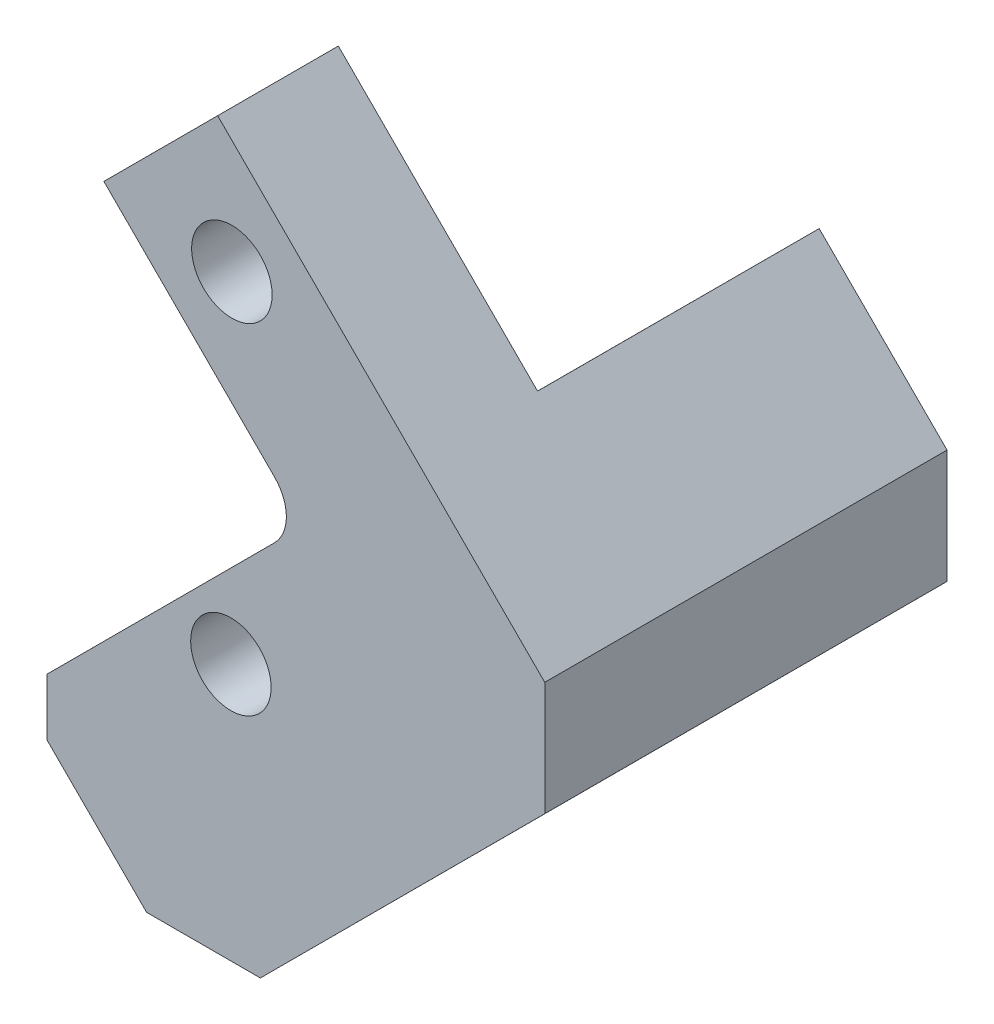
ISO-10303-21;
HEADER;
FILE_DESCRIPTION(('STEP AP214'),'2;1');
FILE_NAME('part.step','',(''),(''),'','','');
FILE_SCHEMA(('AUTOMOTIVE_DESIGN { 1 0 10303 214 1 1 1 1 }'));
ENDSEC;
DATA;
#1=APPLICATION_CONTEXT('core data for automotive mechanical design processes');
#2=APPLICATION_PROTOCOL_DEFINITION('international standard','automotive_design',2000,#1);
#3=PRODUCT_CONTEXT('',#1,'mechanical');
#4=PRODUCT('Part','Part','',(#3));
#5=PRODUCT_RELATED_PRODUCT_CATEGORY('part','',(#4));
#6=PRODUCT_DEFINITION_FORMATION('','',#4);
#7=PRODUCT_DEFINITION_CONTEXT('part definition',#1,'design');
#8=PRODUCT_DEFINITION('design','',#6,#7);
#9=PRODUCT_DEFINITION_SHAPE('','',#8);
#10=(LENGTH_UNIT() NAMED_UNIT(*) SI_UNIT(.MILLI.,.METRE.));
#11=(NAMED_UNIT(*) PLANE_ANGLE_UNIT() SI_UNIT($,.RADIAN.));
#12=(NAMED_UNIT(*) SI_UNIT($,.STERADIAN.) SOLID_ANGLE_UNIT());
#13=UNCERTAINTY_MEASURE_WITH_UNIT(LENGTH_MEASURE(1.E-05),#10,'distance_accuracy_value','');
#14=(GEOMETRIC_REPRESENTATION_CONTEXT(3) GLOBAL_UNCERTAINTY_ASSIGNED_CONTEXT((#13)) GLOBAL_UNIT_ASSIGNED_CONTEXT((#10,
#11,#12)) REPRESENTATION_CONTEXT('',''));
#15=CARTESIAN_POINT('',(0.,0.,0.));
#16=DIRECTION('',(0.,0.,1.));
#17=DIRECTION('',(1.,0.,0.));
#18=AXIS2_PLACEMENT_3D('',#15,#16,#17);
#19=CARTESIAN_POINT('',(-35.3362008856375,-178.92407937411,0.));
#20=DIRECTION('',(0.,0.,0.999999999999999));
#21=DIRECTION('',(1.,0.,0.));
#22=AXIS2_PLACEMENT_3D('',#19,#20,#21);
#23=PLANE('',#22);
#24=DIRECTION('',(0.000232541189327806,-0.999999972962297,0.));
#25=VECTOR('',#24,1.);
#26=CARTESIAN_POINT('',(-62.2811453828487,-214.8565908524,1.11022302462516E-13));
#27=LINE('',#26,#25);
#28=CARTESIAN_POINT('',(-62.2811424703116,-214.869115674172,2.22044604925031E-13));
#29=VERTEX_POINT('',#28);
#30=CARTESIAN_POINT('',(-62.2790573462297,-223.835802530266,-1.11022302462516E-13));
#31=VERTEX_POINT('',#30);
#32=EDGE_CURVE('E280',#29,#31,#27,.T.);
#33=ORIENTED_EDGE('',*,*,#32,.F.);
#34=DIRECTION('',(-0.707188992132999,-0.707024560680825,0.));
#35=VECTOR('',#34,1.);
#36=CARTESIAN_POINT('',(18.5641299909767,-134.042640883238,1.11022302462516E-13));
#37=LINE('',#36,#35);
#38=CARTESIAN_POINT('',(-3.88912050924617,-156.490670684854,1.11022302462516E-13));
#39=VERTEX_POINT('',#38);
#40=EDGE_CURVE('E309',#39,#29,#37,.T.);
#41=ORIENTED_EDGE('',*,*,#40,.F.);
#42=DIRECTION('',(-0.707024560680825,0.707188992132999,0.));
#43=VECTOR('',#42,1.);
#44=CARTESIAN_POINT('',(-35.3362008856584,-125.036276716552,0.));
#45=LINE('',#44,#43);
#46=CARTESIAN_POINT('',(16.2942692968056,-176.678754506192,1.66533453693773E-13));
#47=VERTEX_POINT('',#46);
#48=EDGE_CURVE('E292',#47,#39,#45,.T.);
#49=ORIENTED_EDGE('',*,*,#48,.F.);
#50=DIRECTION('',(-3.7997383017796E-13,1.,0.));
#51=VECTOR('',#50,1.);
#52=CARTESIAN_POINT('',(16.2942692968124,-194.641354906377,0.));
#53=LINE('',#52,#51);
#54=CARTESIAN_POINT('',(16.2942692968124,-194.641354906377,0.));
#55=VERTEX_POINT('',#54);
#56=EDGE_CURVE('E289',#55,#47,#53,.T.);
#57=ORIENTED_EDGE('',*,*,#56,.F.);
#58=DIRECTION('',(0.707024560680283,0.707188992133541,0.));
#59=VECTOR('',#58,1.);
#60=CARTESIAN_POINT('',(-28.5955276530323,-239.54159179701,1.11022302462516E-13));
#61=LINE('',#60,#59);
#62=CARTESIAN_POINT('',(-28.5955276530323,-239.54159179701,1.11022302462516E-13));
#63=VERTEX_POINT('',#62);
#64=EDGE_CURVE('E287',#63,#55,#61,.T.);
#65=ORIENTED_EDGE('',*,*,#64,.F.);
#66=DIRECTION('',(0.999999972962298,0.000232541189324975,0.));
#67=VECTOR('',#66,1.);
#68=CARTESIAN_POINT('',(-46.55812756755,-239.54576884147,1.11022302462516E-13));
#69=LINE('',#68,#67);
#70=CARTESIAN_POINT('',(-46.55812756755,-239.54576884147,1.11022302462516E-13));
#71=VERTEX_POINT('',#70);
#72=EDGE_CURVE('E284',#71,#63,#69,.T.);
#73=ORIENTED_EDGE('',*,*,#72,.F.);
#74=DIRECTION('',(0.707353385344728,-0.706860090994925,0.));
#75=VECTOR('',#74,1.);
#76=CARTESIAN_POINT('',(-62.2790573462297,-223.835802530266,-1.11022302462516E-13));
#77=LINE('',#76,#75);
#78=EDGE_CURVE('E282',#31,#71,#77,.T.);
#79=ORIENTED_EDGE('',*,*,#78,.F.);
#80=EDGE_LOOP('',(#33,#41,#49,#57,#65,#73,#79));
#81=FACE_BOUND('',#80,.T.);
#82=CARTESIAN_POINT('',(-33.247860059602,-198.975506767725,0.));
#83=DIRECTION('',(0.,0.,0.999999999999999));
#84=DIRECTION('',(1.,0.,0.));
#85=AXIS2_PLACEMENT_3D('',#82,#83,#84);
#86=CIRCLE('',#85,6.35000000000007);
#87=CARTESIAN_POINT('',(-39.5978600596023,-198.975506767725,0.));
#88=VERTEX_POINT('',#87);
#89=EDGE_CURVE('E274',#88,#88,#86,.T.);
#90=ORIENTED_EDGE('',*,*,#89,.T.);
#91=EDGE_LOOP('',(#90));
#92=FACE_BOUND('',#91,.T.);
#93=ADVANCED_FACE('F44',(#81,#92),#23,.F.);
#94=CARTESIAN_POINT('',(-35.3362008856375,-178.92407937411,63.5));
#95=DIRECTION('',(0.,0.,0.999999999999999));
#96=DIRECTION('',(1.,0.,0.));
#97=AXIS2_PLACEMENT_3D('',#94,#95,#96);
#98=PLANE('',#97);
#99=DIRECTION('',(-0.707024560680824,0.707188992133,0.));
#100=VECTOR('',#99,1.);
#101=CARTESIAN_POINT('',(-53.294625212492,-142.998877602412,63.5000000000001));
#102=LINE('',#101,#100);
#103=CARTESIAN_POINT('',(-26.3559447038848,-169.943823192322,63.5));
#104=VERTEX_POINT('',#103);
#105=CARTESIAN_POINT('',(-53.294625212492,-142.998877602412,63.5000000000001));
#106=VERTEX_POINT('',#105);
#107=EDGE_CURVE('E137',#104,#106,#102,.T.);
#108=ORIENTED_EDGE('',*,*,#107,.F.);
#109=CARTESIAN_POINT('',(-30.8465948039292,-174.433429152645,63.5));
#110=DIRECTION('',(0.,0.,0.999999999999999));
#111=DIRECTION('',(1.,0.,0.));
#112=AXIS2_PLACEMENT_3D('',#109,#110,#111);
#113=CIRCLE('',#112,6.35);
#114=CARTESIAN_POINT('',(-26.3559447038812,-178.923035112965,63.5));
#115=VERTEX_POINT('',#114);
#116=EDGE_CURVE('E52',#104,#115,#113,.F.);
#117=ORIENTED_EDGE('',*,*,#116,.T.);
#118=DIRECTION('',(-0.707024560680281,-0.707188992133543,0.));
#119=VECTOR('',#118,1.);
#120=CARTESIAN_POINT('',(-30.8455507855898,-183.41368533443,63.5000000000001));
#121=LINE('',#120,#119);
#122=CARTESIAN_POINT('',(-62.2811453828489,-214.8565908524,63.5000000000001));
#123=VERTEX_POINT('',#122);
#124=EDGE_CURVE('E260',#115,#123,#121,.T.);
#125=ORIENTED_EDGE('',*,*,#124,.T.);
#126=DIRECTION('',(0.000232541189327806,-0.999999972962297,0.));
#127=VECTOR('',#126,1.);
#128=CARTESIAN_POINT('',(-62.2811453828489,-214.8565908524,63.5000000000001));
#129=LINE('',#128,#127);
#130=CARTESIAN_POINT('',(-62.2790573462295,-223.835802530266,63.5));
#131=VERTEX_POINT('',#130);
#132=EDGE_CURVE('E259',#123,#131,#129,.T.);
#133=ORIENTED_EDGE('',*,*,#132,.T.);
#134=DIRECTION('',(0.707353385344728,-0.706860090994925,0.));
#135=VECTOR('',#134,1.);
#136=CARTESIAN_POINT('',(-62.2790573462295,-223.835802530266,63.5));
#137=LINE('',#136,#135);
#138=CARTESIAN_POINT('',(-46.5581275675504,-239.54576884147,63.5));
#139=VERTEX_POINT('',#138);
#140=EDGE_CURVE('E297',#131,#139,#137,.T.);
#141=ORIENTED_EDGE('',*,*,#140,.T.);
#142=DIRECTION('',(0.999999972962298,0.000232541189324975,0.));
#143=VECTOR('',#142,1.);
#144=CARTESIAN_POINT('',(-46.5581275675504,-239.54576884147,63.5));
#145=LINE('',#144,#143);
#146=CARTESIAN_POINT('',(-28.5955276530325,-239.54159179701,63.5));
#147=VERTEX_POINT('',#146);
#148=EDGE_CURVE('E299',#139,#147,#145,.T.);
#149=ORIENTED_EDGE('',*,*,#148,.T.);
#150=DIRECTION('',(0.707024560680283,0.707188992133541,0.));
#151=VECTOR('',#150,1.);
#152=CARTESIAN_POINT('',(-28.5955276530325,-239.54159179701,63.5));
#153=LINE('',#152,#151);
#154=CARTESIAN_POINT('',(16.2942692968122,-194.641354906377,63.5000000000001));
#155=VERTEX_POINT('',#154);
#156=EDGE_CURVE('E301',#147,#155,#153,.T.);
#157=ORIENTED_EDGE('',*,*,#156,.T.);
#158=DIRECTION('',(-3.7997383017796E-13,1.,0.));
#159=VECTOR('',#158,1.);
#160=CARTESIAN_POINT('',(16.2942692968122,-194.641354906377,63.5000000000001));
#161=LINE('',#160,#159);
#162=CARTESIAN_POINT('',(16.2942692968058,-176.678754506192,63.4999999999999));
#163=VERTEX_POINT('',#162);
#164=EDGE_CURVE('E164',#155,#163,#161,.T.);
#165=ORIENTED_EDGE('',*,*,#164,.T.);
#166=DIRECTION('',(-0.707024560680825,0.707188992132999,0.));
#167=VECTOR('',#166,1.);
#168=CARTESIAN_POINT('',(16.2942692968058,-176.678754506192,63.4999999999999));
#169=LINE('',#168,#167);
#170=CARTESIAN_POINT('',(-35.3362008856584,-125.036276716552,63.5000000000001));
#171=VERTEX_POINT('',#170);
#172=EDGE_CURVE('E158',#163,#171,#169,.T.);
#173=ORIENTED_EDGE('',*,*,#172,.T.);
#174=DIRECTION('',(-0.707024560680282,-0.707188992133542,0.));
#175=VECTOR('',#174,1.);
#176=CARTESIAN_POINT('',(-35.3362008856584,-125.036276716552,63.5000000000001));
#177=LINE('',#176,#175);
#178=EDGE_CURVE('E151',#171,#106,#177,.T.);
#179=ORIENTED_EDGE('',*,*,#178,.T.);
#180=EDGE_LOOP('',(#108,#117,#125,#133,#141,#149,#157,#165,#173,#179));
#181=FACE_BOUND('',#180,.T.);
#182=CARTESIAN_POINT('',(-33.0913978447953,-145.244202713136,63.5));
#183=DIRECTION('',(0.,0.,0.999999999999999));
#184=DIRECTION('',(1.,0.,0.));
#185=AXIS2_PLACEMENT_3D('',#182,#183,#184);
#186=CIRCLE('',#185,6.34999999999999);
#187=CARTESIAN_POINT('',(-26.7413978447953,-145.244202713136,63.5));
#188=VERTEX_POINT('',#187);
#189=EDGE_CURVE('E268',#188,#188,#186,.T.);
#190=ORIENTED_EDGE('',*,*,#189,.F.);
#191=EDGE_LOOP('',(#190));
#192=FACE_BOUND('',#191,.T.);
#193=CARTESIAN_POINT('',(-33.2478600596022,-198.975506767725,63.5000000000001));
#194=DIRECTION('',(0.,0.,0.999999999999999));
#195=DIRECTION('',(1.,0.,0.));
#196=AXIS2_PLACEMENT_3D('',#193,#194,#195);
#197=CIRCLE('',#196,6.35000000000007);
#198=CARTESIAN_POINT('',(-39.5978600596023,-198.975506767725,63.5000000000001));
#199=VERTEX_POINT('',#198);
#200=EDGE_CURVE('E277',#199,#199,#197,.T.);
#201=ORIENTED_EDGE('',*,*,#200,.F.);
#202=EDGE_LOOP('',(#201));
#203=FACE_BOUND('',#202,.T.);
#204=ADVANCED_FACE('F155',(#181,#192,#203),#98,.T.);
#205=CARTESIAN_POINT('',(-30.8455507855898,-183.41368533443,63.5000000000001));
#206=DIRECTION('',(0.707188992133543,-0.707024560680281,0.));
#207=DIRECTION('',(0.707024560680281,0.707188992133543,0.));
#208=AXIS2_PLACEMENT_3D('',#205,#206,#207);
#209=PLANE('',#208);
#210=ORIENTED_EDGE('',*,*,#124,.F.);
#211=DIRECTION('',(0.,0.,0.999999999999999));
#212=VECTOR('',#211,1.);
#213=CARTESIAN_POINT('',(-26.355944703881,-178.923035112965,44.45));
#214=LINE('',#213,#212);
#215=CARTESIAN_POINT('',(-26.355944703881,-178.923035112965,44.45));
#216=VERTEX_POINT('',#215);
#217=EDGE_CURVE('E59',#115,#216,#214,.F.);
#218=ORIENTED_EDGE('',*,*,#217,.T.);
#219=DIRECTION('',(-0.707024560680281,-0.707188992133543,0.));
#220=VECTOR('',#219,1.);
#221=CARTESIAN_POINT('',(-30.8455507855894,-183.41368533443,44.45));
#222=LINE('',#221,#220);
#223=CARTESIAN_POINT('',(-62.2811453828489,-214.8565908524,44.4500000000001));
#224=VERTEX_POINT('',#223);
#225=EDGE_CURVE('E261',#216,#224,#222,.T.);
#226=ORIENTED_EDGE('',*,*,#225,.T.);
#227=DIRECTION('',(0.,0.,-0.999999999999999));
#228=VECTOR('',#227,1.);
#229=CARTESIAN_POINT('',(-62.2811453828489,-214.8565908524,63.5000000000001));
#230=LINE('',#229,#228);
#231=EDGE_CURVE('E183',#123,#224,#230,.T.);
#232=ORIENTED_EDGE('',*,*,#231,.F.);
#233=EDGE_LOOP('',(#210,#218,#226,#232));
#234=FACE_BOUND('',#233,.T.);
#235=ADVANCED_FACE('F46',(#234),#209,.F.);
#236=CARTESIAN_POINT('',(-62.2811453828489,-214.8565908524,63.5000000000001));
#237=DIRECTION('',(0.999999972962298,0.000232541189327806,0.));
#238=DIRECTION('',(-0.000232541189327862,0.999999972962297,0.));
#239=AXIS2_PLACEMENT_3D('',#236,#237,#238);
#240=PLANE('',#239);
#241=ORIENTED_EDGE('',*,*,#231,.T.);
#242=DIRECTION('',(0.000232541189327862,-0.999999972962297,0.));
#243=VECTOR('',#242,1.);
#244=CARTESIAN_POINT('',(-62.2811453828489,-214.8565908524,44.4500000000001));
#245=LINE('',#244,#243);
#246=CARTESIAN_POINT('',(-62.281142470312,-214.869115674172,44.4500000000001));
#247=VERTEX_POINT('',#246);
#248=EDGE_CURVE('E257',#224,#247,#245,.T.);
#249=ORIENTED_EDGE('',*,*,#248,.T.);
#250=DIRECTION('',(0.,0.,-0.999999999999999));
#251=VECTOR('',#250,1.);
#252=CARTESIAN_POINT('',(-62.2811424703118,-214.869115674172,63.5000000000001));
#253=LINE('',#252,#251);
#254=EDGE_CURVE('E266',#247,#29,#253,.T.);
#255=ORIENTED_EDGE('',*,*,#254,.T.);
#256=ORIENTED_EDGE('',*,*,#32,.T.);
#257=DIRECTION('',(0.,0.,-0.999999999999999));
#258=VECTOR('',#257,1.);
#259=CARTESIAN_POINT('',(-62.2790573462295,-223.835802530266,63.5));
#260=LINE('',#259,#258);
#261=EDGE_CURVE('E180',#131,#31,#260,.T.);
#262=ORIENTED_EDGE('',*,*,#261,.F.);
#263=ORIENTED_EDGE('',*,*,#132,.F.);
#264=EDGE_LOOP('',(#241,#249,#255,#256,#262,#263));
#265=FACE_BOUND('',#264,.T.);
#266=ADVANCED_FACE('F245',(#265),#240,.F.);
#267=CARTESIAN_POINT('',(-62.2790573462295,-223.835802530266,63.5));
#268=DIRECTION('',(0.706860090994925,0.707353385344728,0.));
#269=DIRECTION('',(-0.707353385344728,0.706860090994925,0.));
#270=AXIS2_PLACEMENT_3D('',#267,#268,#269);
#271=PLANE('',#270);
#272=ORIENTED_EDGE('',*,*,#78,.T.);
#273=DIRECTION('',(0.,0.,-0.999999999999999));
#274=VECTOR('',#273,1.);
#275=CARTESIAN_POINT('',(-46.5581275675504,-239.54576884147,63.5));
#276=LINE('',#275,#274);
#277=EDGE_CURVE('E177',#139,#71,#276,.T.);
#278=ORIENTED_EDGE('',*,*,#277,.F.);
#279=ORIENTED_EDGE('',*,*,#140,.F.);
#280=ORIENTED_EDGE('',*,*,#261,.T.);
#281=EDGE_LOOP('',(#272,#278,#279,#280));
#282=FACE_BOUND('',#281,.T.);
#283=ADVANCED_FACE('F242',(#282),#271,.F.);
#284=CARTESIAN_POINT('',(-46.5581275675504,-239.54576884147,63.5));
#285=DIRECTION('',(-0.00023254118932492,0.999999972962297,0.));
#286=DIRECTION('',(-0.999999972962298,-0.000232541189324975,0.));
#287=AXIS2_PLACEMENT_3D('',#284,#285,#286);
#288=PLANE('',#287);
#289=DIRECTION('',(0.,0.,-0.999999999999999));
#290=VECTOR('',#289,1.);
#291=CARTESIAN_POINT('',(-28.5955276530325,-239.54159179701,63.5));
#292=LINE('',#291,#290);
#293=CARTESIAN_POINT('',(-28.5955276530325,-239.54159179701,25.20635639297));
#294=VERTEX_POINT('',#293);
#295=EDGE_CURVE('E173',#294,#63,#292,.T.);
#296=ORIENTED_EDGE('',*,*,#295,.F.);
#297=CARTESIAN_POINT('',(-19.6204918056211,-239.539504731443,25.4000000000001));
#298=DIRECTION('',(-0.00023254118932492,0.999999972962297,0.));
#299=DIRECTION('',(0.999999972962298,0.000232541189324975,0.));
#300=AXIS2_PLACEMENT_3D('',#297,#298,#299);
#301=ELLIPSE('',#300,8.97921216342026,6.34999999999998);
#302=CARTESIAN_POINT('',(-28.5955276530325,-239.54159179701,25.5936436070301));
#303=VERTEX_POINT('',#302);
#304=EDGE_CURVE('E311',#294,#303,#301,.T.);
#305=ORIENTED_EDGE('',*,*,#304,.T.);
#306=EDGE_CURVE('E174',#147,#303,#292,.T.);
#307=ORIENTED_EDGE('',*,*,#306,.F.);
#308=ORIENTED_EDGE('',*,*,#148,.F.);
#309=ORIENTED_EDGE('',*,*,#277,.T.);
#310=ORIENTED_EDGE('',*,*,#72,.T.);
#311=EDGE_LOOP('',(#296,#305,#307,#308,#309,#310));
#312=FACE_BOUND('',#311,.T.);
#313=ADVANCED_FACE('F238',(#312),#288,.F.);
#314=CARTESIAN_POINT('',(-28.5955276530325,-239.54159179701,63.5));
#315=DIRECTION('',(-0.707188992133541,0.707024560680283,0.));
#316=DIRECTION('',(-0.707024560680283,-0.707188992133541,0.));
#317=AXIS2_PLACEMENT_3D('',#314,#315,#316);
#318=PLANE('',#317);
#319=ORIENTED_EDGE('',*,*,#306,.T.);
#320=CARTESIAN_POINT('',(-24.1080097293285,-235.053030219189,25.3999999999999));
#321=DIRECTION('',(-0.707188992133541,0.707024560680283,0.));
#322=DIRECTION('',(-0.707024560680283,-0.707188992133541,0.));
#323=AXIS2_PLACEMENT_3D('',#320,#321,#322);
#324=CIRCLE('',#323,6.34999999999998);
#325=EDGE_CURVE('E193',#303,#294,#324,.T.);
#326=ORIENTED_EDGE('',*,*,#325,.T.);
#327=ORIENTED_EDGE('',*,*,#295,.T.);
#328=ORIENTED_EDGE('',*,*,#64,.T.);
#329=DIRECTION('',(0.,0.,-0.999999999999999));
#330=VECTOR('',#329,1.);
#331=CARTESIAN_POINT('',(16.2942692968122,-194.641354906377,63.5000000000001));
#332=LINE('',#331,#330);
#333=EDGE_CURVE('E170',#155,#55,#332,.T.);
#334=ORIENTED_EDGE('',*,*,#333,.F.);
#335=ORIENTED_EDGE('',*,*,#156,.F.);
#336=EDGE_LOOP('',(#319,#326,#327,#328,#334,#335));
#337=FACE_BOUND('',#336,.T.);
#338=ADVANCED_FACE('F234',(#337),#318,.F.);
#339=CARTESIAN_POINT('',(16.2942692968122,-194.641354906377,63.5000000000001));
#340=DIRECTION('',(-1.,-3.80140363631654E-13,0.));
#341=DIRECTION('',(3.7997383017796E-13,-1.,0.));
#342=AXIS2_PLACEMENT_3D('',#339,#340,#341);
#343=PLANE('',#342);
#344=ORIENTED_EDGE('',*,*,#56,.T.);
#345=DIRECTION('',(0.,0.,-0.999999999999999));
#346=VECTOR('',#345,1.);
#347=CARTESIAN_POINT('',(16.2942692968058,-176.678754506192,63.4999999999999));
#348=LINE('',#347,#346);
#349=EDGE_CURVE('E162',#163,#47,#348,.T.);
#350=ORIENTED_EDGE('',*,*,#349,.F.);
#351=ORIENTED_EDGE('',*,*,#164,.F.);
#352=ORIENTED_EDGE('',*,*,#333,.T.);
#353=EDGE_LOOP('',(#344,#350,#351,#352));
#354=FACE_BOUND('',#353,.T.);
#355=ADVANCED_FACE('F230',(#354),#343,.F.);
#356=CARTESIAN_POINT('',(-35.3362008856584,-125.036276716552,63.5000000000001));
#357=DIRECTION('',(-0.707188992133,-0.707024560680824,0.));
#358=DIRECTION('',(0.707024560680825,-0.707188992132999,0.));
#359=AXIS2_PLACEMENT_3D('',#356,#357,#358);
#360=PLANE('',#359);
#361=ORIENTED_EDGE('',*,*,#48,.T.);
#362=DIRECTION('',(0.,0.,0.999999999999999));
#363=VECTOR('',#362,1.);
#364=CARTESIAN_POINT('',(-3.88912050924595,-156.490670684854,63.5000000000001));
#365=LINE('',#364,#363);
#366=CARTESIAN_POINT('',(-3.88912050924617,-156.490670684854,44.4500000000001));
#367=VERTEX_POINT('',#366);
#368=EDGE_CURVE('E186',#39,#367,#365,.T.);
#369=ORIENTED_EDGE('',*,*,#368,.T.);
#370=DIRECTION('',(-0.707024560680825,0.707188992132999,0.));
#371=VECTOR('',#370,1.);
#372=CARTESIAN_POINT('',(-35.3362008856584,-125.036276716552,44.45));
#373=LINE('',#372,#371);
#374=CARTESIAN_POINT('',(-35.3362008856584,-125.036276716552,44.45));
#375=VERTEX_POINT('',#374);
#376=EDGE_CURVE('E262',#367,#375,#373,.T.);
#377=ORIENTED_EDGE('',*,*,#376,.T.);
#378=DIRECTION('',(0.,0.,-0.999999999999999));
#379=VECTOR('',#378,1.);
#380=CARTESIAN_POINT('',(-35.3362008856584,-125.036276716552,63.5000000000001));
#381=LINE('',#380,#379);
#382=EDGE_CURVE('E160',#171,#375,#381,.T.);
#383=ORIENTED_EDGE('',*,*,#382,.F.);
#384=ORIENTED_EDGE('',*,*,#172,.F.);
#385=ORIENTED_EDGE('',*,*,#349,.T.);
#386=EDGE_LOOP('',(#361,#369,#377,#383,#384,#385));
#387=FACE_BOUND('',#386,.T.);
#388=ADVANCED_FACE('F227',(#387),#360,.F.);
#389=CARTESIAN_POINT('',(-35.3362008856584,-125.036276716552,63.5000000000001));
#390=DIRECTION('',(0.707188992133542,-0.707024560680281,0.));
#391=DIRECTION('',(0.707024560680282,0.707188992133542,0.));
#392=AXIS2_PLACEMENT_3D('',#389,#390,#391);
#393=PLANE('',#392);
#394=DIRECTION('',(-0.707024560680282,-0.707188992133542,0.));
#395=VECTOR('',#394,1.);
#396=CARTESIAN_POINT('',(-35.3362008856584,-125.036276716552,44.45));
#397=LINE('',#396,#395);
#398=CARTESIAN_POINT('',(-53.294625212492,-142.998877602412,44.45));
#399=VERTEX_POINT('',#398);
#400=EDGE_CURVE('E152',#375,#399,#397,.T.);
#401=ORIENTED_EDGE('',*,*,#400,.T.);
#402=DIRECTION('',(0.,0.,0.999999999999999));
#403=VECTOR('',#402,1.);
#404=CARTESIAN_POINT('',(-53.2946252124917,-142.998877602412,0.));
#405=LINE('',#404,#403);
#406=EDGE_CURVE('E141',#399,#106,#405,.T.);
#407=ORIENTED_EDGE('',*,*,#406,.T.);
#408=ORIENTED_EDGE('',*,*,#178,.F.);
#409=ORIENTED_EDGE('',*,*,#382,.T.);
#410=EDGE_LOOP('',(#401,#407,#408,#409));
#411=FACE_BOUND('',#410,.T.);
#412=ADVANCED_FACE('F149',(#411),#393,.F.);
#413=CARTESIAN_POINT('',(-33.2478600596022,-198.975506767725,63.5000000000001));
#414=DIRECTION('',(0.,0.,-0.999999999999999));
#415=DIRECTION('',(-1.,0.,0.));
#416=AXIS2_PLACEMENT_3D('',#413,#414,#415);
#417=CYLINDRICAL_SURFACE('',#416,6.35000000000007);
#418=CARTESIAN_POINT('',(-39.5978600596023,-198.975506767725,63.5000000000001));
#419=CARTESIAN_POINT('',(-39.5978600596023,-198.975506767725,62.8385416666667));
#420=CARTESIAN_POINT('',(-39.5978600596023,-198.975506767725,62.1770833333334));
#421=CARTESIAN_POINT('',(-39.5978600596023,-198.975506767725,60.8541666666667));
#422=CARTESIAN_POINT('',(-39.5978600596023,-198.975506767725,60.1927083333334));
#423=CARTESIAN_POINT('',(-39.5978600596023,-198.975506767725,58.8697916666667));
#424=CARTESIAN_POINT('',(-39.5978600596023,-198.975506767725,58.2083333333334));
#425=CARTESIAN_POINT('',(-39.5978600596023,-198.975506767725,56.8854166666667));
#426=CARTESIAN_POINT('',(-39.5978600596023,-198.975506767725,56.2239583333334));
#427=CARTESIAN_POINT('',(-39.5978600596023,-198.975506767725,54.9010416666667));
#428=CARTESIAN_POINT('',(-39.5978600596023,-198.975506767725,54.2395833333334));
#429=CARTESIAN_POINT('',(-39.5978600596023,-198.975506767725,52.9166666666667));
#430=CARTESIAN_POINT('',(-39.5978600596023,-198.975506767725,52.2552083333334));
#431=CARTESIAN_POINT('',(-39.5978600596023,-198.975506767725,50.9322916666667));
#432=CARTESIAN_POINT('',(-39.5978600596023,-198.975506767725,50.2708333333334));
#433=CARTESIAN_POINT('',(-39.5978600596023,-198.975506767725,48.9479166666667));
#434=CARTESIAN_POINT('',(-39.5978600596023,-198.975506767725,48.2864583333334));
#435=CARTESIAN_POINT('',(-39.5978600596023,-198.975506767725,46.9635416666667));
#436=CARTESIAN_POINT('',(-39.5978600596023,-198.975506767725,46.3020833333334));
#437=CARTESIAN_POINT('',(-39.5978600596023,-198.975506767725,44.9791666666667));
#438=CARTESIAN_POINT('',(-39.5978600596023,-198.975506767725,44.3177083333334));
#439=CARTESIAN_POINT('',(-39.5978600596023,-198.975506767725,42.9947916666667));
#440=CARTESIAN_POINT('',(-39.5978600596023,-198.975506767725,42.3333333333334));
#441=CARTESIAN_POINT('',(-39.5978600596023,-198.975506767725,41.0104166666667));
#442=CARTESIAN_POINT('',(-39.5978600596023,-198.975506767725,40.3489583333334));
#443=CARTESIAN_POINT('',(-39.5978600596023,-198.975506767725,39.0260416666667));
#444=CARTESIAN_POINT('',(-39.5978600596023,-198.975506767725,38.3645833333334));
#445=CARTESIAN_POINT('',(-39.5978600596023,-198.975506767725,37.0416666666667));
#446=CARTESIAN_POINT('',(-39.5978600596023,-198.975506767725,36.3802083333334));
#447=CARTESIAN_POINT('',(-39.5978600596023,-198.975506767725,35.0572916666667));
#448=CARTESIAN_POINT('',(-39.5978600596023,-198.975506767725,34.3958333333334));
#449=CARTESIAN_POINT('',(-39.5978600596023,-198.975506767725,33.0729166666667));
#450=CARTESIAN_POINT('',(-39.5978600596023,-198.975506767725,32.4114583333334));
#451=CARTESIAN_POINT('',(-39.5978600596023,-198.975506767725,31.0885416666667));
#452=CARTESIAN_POINT('',(-39.5978600596023,-198.975506767725,30.4270833333334));
#453=CARTESIAN_POINT('',(-39.5978600596023,-198.975506767725,29.1041666666667));
#454=CARTESIAN_POINT('',(-39.5978600596023,-198.975506767725,28.4427083333334));
#455=CARTESIAN_POINT('',(-39.5978600596023,-198.975506767725,27.1197916666667));
#456=CARTESIAN_POINT('',(-39.5978600596023,-198.975506767725,26.4583333333334));
#457=CARTESIAN_POINT('',(-39.5978600596023,-198.975506767725,25.1354166666667));
#458=CARTESIAN_POINT('',(-39.5978600596023,-198.975506767725,24.4739583333334));
#459=CARTESIAN_POINT('',(-39.5978600596023,-198.975506767725,23.1510416666667));
#460=CARTESIAN_POINT('',(-39.5978600596023,-198.975506767725,22.4895833333333));
#461=CARTESIAN_POINT('',(-39.5978600596023,-198.975506767725,21.1666666666667));
#462=CARTESIAN_POINT('',(-39.5978600596023,-198.975506767725,20.5052083333333));
#463=CARTESIAN_POINT('',(-39.5978600596023,-198.975506767725,19.1822916666667));
#464=CARTESIAN_POINT('',(-39.5978600596023,-198.975506767725,18.5208333333333));
#465=CARTESIAN_POINT('',(-39.5978600596023,-198.975506767725,17.1979166666667));
#466=CARTESIAN_POINT('',(-39.5978600596023,-198.975506767725,16.5364583333333));
#467=CARTESIAN_POINT('',(-39.5978600596023,-198.975506767725,15.2135416666667));
#468=CARTESIAN_POINT('',(-39.5978600596023,-198.975506767725,14.5520833333333));
#469=CARTESIAN_POINT('',(-39.5978600596023,-198.975506767725,13.2291666666667));
#470=CARTESIAN_POINT('',(-39.5978600596023,-198.975506767725,12.5677083333333));
#471=CARTESIAN_POINT('',(-39.5978600596023,-198.975506767725,11.2447916666667));
#472=CARTESIAN_POINT('',(-39.5978600596023,-198.975506767725,10.5833333333333));
#473=CARTESIAN_POINT('',(-39.5978600596023,-198.975506767725,9.26041666666666));
#474=CARTESIAN_POINT('',(-39.5978600596023,-198.975506767725,8.59895833333332));
#475=CARTESIAN_POINT('',(-39.5978600596023,-198.975506767725,7.27604166666665));
#476=CARTESIAN_POINT('',(-39.5978600596023,-198.975506767725,6.61458333333332));
#477=CARTESIAN_POINT('',(-39.5978600596023,-198.975506767725,5.29166666666666));
#478=CARTESIAN_POINT('',(-39.5978600596023,-198.975506767725,4.63020833333332));
#479=CARTESIAN_POINT('',(-39.5978600596023,-198.975506767725,3.30729166666665));
#480=CARTESIAN_POINT('',(-39.5978600596023,-198.975506767725,2.64583333333332));
#481=CARTESIAN_POINT('',(-39.5978600596023,-198.975506767725,1.32291666666665));
#482=CARTESIAN_POINT('',(-39.5978600596023,-198.975506767725,0.661458333333318));
#483=CARTESIAN_POINT('',(-39.5978600596023,-198.975506767725,0.));
#484=B_SPLINE_CURVE_WITH_KNOTS('',3,(#418,#419,#420,#421,#422,#423,#424,#425,#426,#427,#428,
#429,#430,#431,#432,#433,#434,#435,#436,#437,#438,#439,#440,#441,#442,#443,#444,#445,#446,#447,
#448,#449,#450,#451,#452,#453,#454,#455,#456,#457,#458,#459,#460,#461,#462,#463,#464,#465,#466,
#467,#468,#469,#470,#471,#472,#473,#474,#475,#476,#477,#478,#479,#480,#481,#482,#483),
.UNSPECIFIED.,.F.,.F.,(4,2,2,2,2,2,2,2,2,2,2,2,2,2,2,2,2,2,2,2,2,2,2,2,2,2,2,2,2,2,2,2,4),(0.,
1.98437500000001,3.96875000000001,5.95312500000002,7.93750000000002,9.92187500000002,11.90625,
13.890625,15.875,17.859375,19.84375,21.828125,23.8125,25.796875,27.78125,29.7656250000001,
31.7500000000001,33.7343750000001,35.7187500000001,37.7031250000001,39.6875000000001,
41.6718750000001,43.6562500000001,45.6406250000001,47.6250000000001,49.6093750000001,
51.5937500000001,53.5781250000001,55.5625000000001,57.5468750000001,59.5312500000001,
61.5156250000001,63.5000000000001),.UNSPECIFIED.);
#485=EDGE_CURVE('BSEAM222',#199,#88,#484,.T.);
#486=ORIENTED_EDGE('',*,*,#200,.T.);
#487=ORIENTED_EDGE('',*,*,#89,.F.);
#488=ORIENTED_EDGE('',*,*,#485,.T.);
#489=ORIENTED_EDGE('',*,*,#485,.F.);
#490=EDGE_LOOP('',(#486,#488,#487,#489));
#491=FACE_BOUND('',#490,.T.);
#492=ADVANCED_FACE('F222',(#491),#417,.F.);
#493=CARTESIAN_POINT('',(-33.0913978447953,-145.244202713136,63.5));
#494=DIRECTION('',(0.,0.,0.999999999999999));
#495=DIRECTION('',(1.,0.,0.));
#496=AXIS2_PLACEMENT_3D('',#493,#494,#495);
#497=CYLINDRICAL_SURFACE('',#496,6.34999999999999);
#498=CARTESIAN_POINT('',(-33.0913978447953,-145.244202713136,44.45));
#499=DIRECTION('',(0.,0.,0.999999999999999));
#500=DIRECTION('',(1.,0.,0.));
#501=AXIS2_PLACEMENT_3D('',#498,#499,#500);
#502=CIRCLE('',#501,6.34999999999999);
#503=CARTESIAN_POINT('',(-26.7413978447953,-145.244202713136,44.45));
#504=VERTEX_POINT('',#503);
#505=EDGE_CURVE('E187',#504,#504,#502,.F.);
#506=CARTESIAN_POINT('',(-26.7413978447953,-145.244202713136,44.45));
#507=CARTESIAN_POINT('',(-26.7413978447953,-145.244202713136,44.6484375));
#508=CARTESIAN_POINT('',(-26.7413978447953,-145.244202713136,44.846875));
#509=CARTESIAN_POINT('',(-26.7413978447953,-145.244202713136,45.24375));
#510=CARTESIAN_POINT('',(-26.7413978447953,-145.244202713136,45.4421875));
#511=CARTESIAN_POINT('',(-26.7413978447953,-145.244202713136,45.8390625));
#512=CARTESIAN_POINT('',(-26.7413978447953,-145.244202713136,46.0375));
#513=CARTESIAN_POINT('',(-26.7413978447953,-145.244202713136,46.434375));
#514=CARTESIAN_POINT('',(-26.7413978447953,-145.244202713136,46.6328125));
#515=CARTESIAN_POINT('',(-26.7413978447953,-145.244202713136,47.0296875));
#516=CARTESIAN_POINT('',(-26.7413978447953,-145.244202713136,47.228125));
#517=CARTESIAN_POINT('',(-26.7413978447953,-145.244202713136,47.625));
#518=CARTESIAN_POINT('',(-26.7413978447953,-145.244202713136,47.8234375));
#519=CARTESIAN_POINT('',(-26.7413978447953,-145.244202713136,48.2203125));
#520=CARTESIAN_POINT('',(-26.7413978447953,-145.244202713136,48.41875));
#521=CARTESIAN_POINT('',(-26.7413978447953,-145.244202713136,48.815625));
#522=CARTESIAN_POINT('',(-26.7413978447953,-145.244202713136,49.0140625));
#523=CARTESIAN_POINT('',(-26.7413978447953,-145.244202713136,49.4109375));
#524=CARTESIAN_POINT('',(-26.7413978447953,-145.244202713136,49.609375));
#525=CARTESIAN_POINT('',(-26.7413978447953,-145.244202713136,50.00625));
#526=CARTESIAN_POINT('',(-26.7413978447953,-145.244202713136,50.2046875));
#527=CARTESIAN_POINT('',(-26.7413978447953,-145.244202713136,50.6015625));
#528=CARTESIAN_POINT('',(-26.7413978447953,-145.244202713136,50.8));
#529=CARTESIAN_POINT('',(-26.7413978447953,-145.244202713136,51.196875));
#530=CARTESIAN_POINT('',(-26.7413978447953,-145.244202713136,51.3953125));
#531=CARTESIAN_POINT('',(-26.7413978447953,-145.244202713136,51.7921875));
#532=CARTESIAN_POINT('',(-26.7413978447953,-145.244202713136,51.990625));
#533=CARTESIAN_POINT('',(-26.7413978447953,-145.244202713136,52.3875));
#534=CARTESIAN_POINT('',(-26.7413978447953,-145.244202713136,52.5859375));
#535=CARTESIAN_POINT('',(-26.7413978447953,-145.244202713136,52.9828125));
#536=CARTESIAN_POINT('',(-26.7413978447953,-145.244202713136,53.18125));
#537=CARTESIAN_POINT('',(-26.7413978447953,-145.244202713136,53.578125));
#538=CARTESIAN_POINT('',(-26.7413978447953,-145.244202713136,53.7765625));
#539=CARTESIAN_POINT('',(-26.7413978447953,-145.244202713136,54.1734375));
#540=CARTESIAN_POINT('',(-26.7413978447953,-145.244202713136,54.371875));
#541=CARTESIAN_POINT('',(-26.7413978447953,-145.244202713136,54.76875));
#542=CARTESIAN_POINT('',(-26.7413978447953,-145.244202713136,54.9671875));
#543=CARTESIAN_POINT('',(-26.7413978447953,-145.244202713136,55.3640625));
#544=CARTESIAN_POINT('',(-26.7413978447953,-145.244202713136,55.5625));
#545=CARTESIAN_POINT('',(-26.7413978447953,-145.244202713136,55.959375));
#546=CARTESIAN_POINT('',(-26.7413978447953,-145.244202713136,56.1578125));
#547=CARTESIAN_POINT('',(-26.7413978447953,-145.244202713136,56.5546875));
#548=CARTESIAN_POINT('',(-26.7413978447953,-145.244202713136,56.753125));
#549=CARTESIAN_POINT('',(-26.7413978447953,-145.244202713136,57.15));
#550=CARTESIAN_POINT('',(-26.7413978447953,-145.244202713136,57.3484375));
#551=CARTESIAN_POINT('',(-26.7413978447953,-145.244202713136,57.7453125));
#552=CARTESIAN_POINT('',(-26.7413978447953,-145.244202713136,57.94375));
#553=CARTESIAN_POINT('',(-26.7413978447953,-145.244202713136,58.340625));
#554=CARTESIAN_POINT('',(-26.7413978447953,-145.244202713136,58.5390625));
#555=CARTESIAN_POINT('',(-26.7413978447953,-145.244202713136,58.9359375));
#556=CARTESIAN_POINT('',(-26.7413978447953,-145.244202713136,59.134375));
#557=CARTESIAN_POINT('',(-26.7413978447953,-145.244202713136,59.53125));
#558=CARTESIAN_POINT('',(-26.7413978447953,-145.244202713136,59.7296875));
#559=CARTESIAN_POINT('',(-26.7413978447953,-145.244202713136,60.1265625));
#560=CARTESIAN_POINT('',(-26.7413978447953,-145.244202713136,60.325));
#561=CARTESIAN_POINT('',(-26.7413978447953,-145.244202713136,60.721875));
#562=CARTESIAN_POINT('',(-26.7413978447953,-145.244202713136,60.9203125));
#563=CARTESIAN_POINT('',(-26.7413978447953,-145.244202713136,61.3171875));
#564=CARTESIAN_POINT('',(-26.7413978447953,-145.244202713136,61.515625));
#565=CARTESIAN_POINT('',(-26.7413978447953,-145.244202713136,61.9125));
#566=CARTESIAN_POINT('',(-26.7413978447953,-145.244202713136,62.1109375));
#567=CARTESIAN_POINT('',(-26.7413978447953,-145.244202713136,62.5078125));
#568=CARTESIAN_POINT('',(-26.7413978447953,-145.244202713136,62.70625));
#569=CARTESIAN_POINT('',(-26.7413978447953,-145.244202713136,63.103125));
#570=CARTESIAN_POINT('',(-26.7413978447953,-145.244202713136,63.3015625));
#571=CARTESIAN_POINT('',(-26.7413978447953,-145.244202713136,63.5));
#572=B_SPLINE_CURVE_WITH_KNOTS('',3,(#506,#507,#508,#509,#510,#511,#512,#513,#514,#515,#516,
#517,#518,#519,#520,#521,#522,#523,#524,#525,#526,#527,#528,#529,#530,#531,#532,#533,#534,#535,
#536,#537,#538,#539,#540,#541,#542,#543,#544,#545,#546,#547,#548,#549,#550,#551,#552,#553,#554,
#555,#556,#557,#558,#559,#560,#561,#562,#563,#564,#565,#566,#567,#568,#569,#570,#571),
.UNSPECIFIED.,.F.,.F.,(4,2,2,2,2,2,2,2,2,2,2,2,2,2,2,2,2,2,2,2,2,2,2,2,2,2,2,2,2,2,2,2,4),(0.,
0.5953125,1.19062499999999,1.78593749999999,2.38124999999999,2.97656249999999,3.571875,
4.1671875,4.7625,5.3578125,5.953125,6.5484375,7.14375,7.73906249999999,8.33437499999999,
8.92968749999999,9.52499999999999,10.1203125,10.715625,11.3109375,11.90625,12.5015625,13.096875,
13.6921875,14.2875,14.8828125,15.478125,16.0734375,16.66875,17.2640625,17.859375,18.4546875,
19.05),.UNSPECIFIED.);
#573=EDGE_CURVE('BSEAM334',#504,#188,#572,.T.);
#574=ORIENTED_EDGE('',*,*,#505,.T.);
#575=ORIENTED_EDGE('',*,*,#189,.T.);
#576=ORIENTED_EDGE('',*,*,#573,.T.);
#577=ORIENTED_EDGE('',*,*,#573,.F.);
#578=EDGE_LOOP('',(#574,#576,#575,#577));
#579=FACE_BOUND('',#578,.T.);
#580=ADVANCED_FACE('F334',(#579),#497,.F.);
#581=CARTESIAN_POINT('',(18.5641299909767,-134.042640883238,1.11022302462516E-13));
#582=DIRECTION('',(0.707024560680825,-0.707188992132999,0.));
#583=DIRECTION('',(0.707188992132999,0.707024560680825,0.));
#584=AXIS2_PLACEMENT_3D('',#581,#582,#583);
#585=PLANE('',#584);
#586=CARTESIAN_POINT('',(-53.2888804410128,-205.878944473096,25.4000000000001));
#587=DIRECTION('',(0.707024560680825,-0.707188992132999,0.));
#588=DIRECTION('',(0.707188992132999,0.707024560680825,0.));
#589=AXIS2_PLACEMENT_3D('',#586,#587,#588);
#590=ELLIPSE('',#589,6.3500001716894,6.34999999999998);
#591=CARTESIAN_POINT('',(-48.7982302195514,-201.389338391384,25.4000000000001));
#592=VERTEX_POINT('',#591);
#593=EDGE_CURVE('E153',#592,#592,#590,.T.);
#594=ORIENTED_EDGE('',*,*,#593,.T.);
#595=EDGE_LOOP('',(#594));
#596=FACE_BOUND('',#595,.T.);
#597=DIRECTION('',(-0.707188992132999,-0.707024560680825,0.));
#598=VECTOR('',#597,1.);
#599=CARTESIAN_POINT('',(18.5641299909767,-134.042640883238,44.45));
#600=LINE('',#599,#598);
#601=EDGE_CURVE('E190',#367,#247,#600,.T.);
#602=ORIENTED_EDGE('',*,*,#601,.F.);
#603=ORIENTED_EDGE('',*,*,#368,.F.);
#604=ORIENTED_EDGE('',*,*,#40,.T.);
#605=ORIENTED_EDGE('',*,*,#254,.F.);
#606=EDGE_LOOP('',(#602,#603,#604,#605));
#607=FACE_BOUND('',#606,.T.);
#608=ADVANCED_FACE('F318',(#596,#607),#585,.F.);
#609=CARTESIAN_POINT('',(18.5641299909767,-134.042640883238,44.45));
#610=DIRECTION('',(0.,0.,0.999999999999999));
#611=DIRECTION('',(1.,0.,0.));
#612=AXIS2_PLACEMENT_3D('',#609,#610,#611);
#613=PLANE('',#612);
#614=ORIENTED_EDGE('',*,*,#505,.F.);
#615=EDGE_LOOP('',(#614));
#616=FACE_BOUND('',#615,.T.);
#617=ORIENTED_EDGE('',*,*,#225,.F.);
#618=CARTESIAN_POINT('',(-30.8465948039292,-174.433429152645,44.4499999999999));
#619=DIRECTION('',(0.,0.,0.999999999999999));
#620=DIRECTION('',(1.,0.,0.));
#621=AXIS2_PLACEMENT_3D('',#618,#619,#620);
#622=CIRCLE('',#621,6.35);
#623=CARTESIAN_POINT('',(-26.3559447038846,-169.943823192322,44.4499999999999));
#624=VERTEX_POINT('',#623);
#625=EDGE_CURVE('E13',#216,#624,#622,.T.);
#626=ORIENTED_EDGE('',*,*,#625,.T.);
#627=DIRECTION('',(-0.707024560680824,0.707188992133,0.));
#628=VECTOR('',#627,1.);
#629=CARTESIAN_POINT('',(-21.8517209094244,-174.449094526147,44.45));
#630=LINE('',#629,#628);
#631=EDGE_CURVE('E196',#624,#399,#630,.T.);
#632=ORIENTED_EDGE('',*,*,#631,.T.);
#633=ORIENTED_EDGE('',*,*,#400,.F.);
#634=ORIENTED_EDGE('',*,*,#376,.F.);
#635=ORIENTED_EDGE('',*,*,#601,.T.);
#636=ORIENTED_EDGE('',*,*,#248,.F.);
#637=EDGE_LOOP('',(#617,#626,#632,#633,#634,#635,#636));
#638=FACE_BOUND('',#637,.T.);
#639=ADVANCED_FACE('F200',(#616,#638),#613,.F.);
#640=CARTESIAN_POINT('',(-24.1080097293285,-235.053030219189,25.3999999999999));
#641=DIRECTION('',(0.707188992133541,-0.707024560680283,0.));
#642=DIRECTION('',(0.707024560680283,0.707188992133541,0.));
#643=AXIS2_PLACEMENT_3D('',#640,#641,#642);
#644=CYLINDRICAL_SURFACE('',#643,6.34999999999998);
#645=ORIENTED_EDGE('',*,*,#593,.F.);
#646=EDGE_LOOP('',(#645));
#647=FACE_BOUND('',#646,.T.);
#648=ORIENTED_EDGE('',*,*,#325,.F.);
#649=ORIENTED_EDGE('',*,*,#304,.F.);
#650=EDGE_LOOP('',(#648,#649));
#651=FACE_BOUND('',#650,.T.);
#652=ADVANCED_FACE('F210',(#647,#651),#644,.F.);
#653=CARTESIAN_POINT('',(-53.2946252124917,-142.998877602412,0.));
#654=DIRECTION('',(0.707188992133,0.707024560680824,0.));
#655=DIRECTION('',(-0.707024560680824,0.707188992133,0.));
#656=AXIS2_PLACEMENT_3D('',#653,#654,#655);
#657=PLANE('',#656);
#658=ORIENTED_EDGE('',*,*,#631,.F.);
#659=DIRECTION('',(0.,0.,0.999999999999999));
#660=VECTOR('',#659,1.);
#661=CARTESIAN_POINT('',(-26.3559447038848,-169.943823192322,63.5));
#662=LINE('',#661,#660);
#663=EDGE_CURVE('E144',#624,#104,#662,.T.);
#664=ORIENTED_EDGE('',*,*,#663,.T.);
#665=ORIENTED_EDGE('',*,*,#107,.T.);
#666=ORIENTED_EDGE('',*,*,#406,.F.);
#667=EDGE_LOOP('',(#658,#664,#665,#666));
#668=FACE_BOUND('',#667,.T.);
#669=ADVANCED_FACE('F140',(#668),#657,.F.);
#670=CARTESIAN_POINT('',(-30.8465948039289,-174.433429152645,0.));
#671=DIRECTION('',(0.,0.,-0.999999999999999));
#672=DIRECTION('',(-1.,0.,0.));
#673=AXIS2_PLACEMENT_3D('',#670,#671,#672);
#674=CYLINDRICAL_SURFACE('',#673,6.35);
#675=ORIENTED_EDGE('',*,*,#625,.F.);
#676=ORIENTED_EDGE('',*,*,#217,.F.);
#677=ORIENTED_EDGE('',*,*,#116,.F.);
#678=ORIENTED_EDGE('',*,*,#663,.F.);
#679=EDGE_LOOP('',(#675,#676,#677,#678));
#680=FACE_BOUND('',#679,.T.);
#681=ADVANCED_FACE('F204',(#680),#674,.F.);
#682=CLOSED_SHELL('',(#93,#204,#235,#266,#283,#313,#338,#355,#388,#412,#492,#580,#608,#639,#652,
#669,#681));
#683=MANIFOLD_SOLID_BREP('B2',#682);
#684=ADVANCED_BREP_SHAPE_REPRESENTATION('',(#18,#683),#14);
#685=SHAPE_DEFINITION_REPRESENTATION(#9,#684);
ENDSEC;
END-ISO-10303-21;
